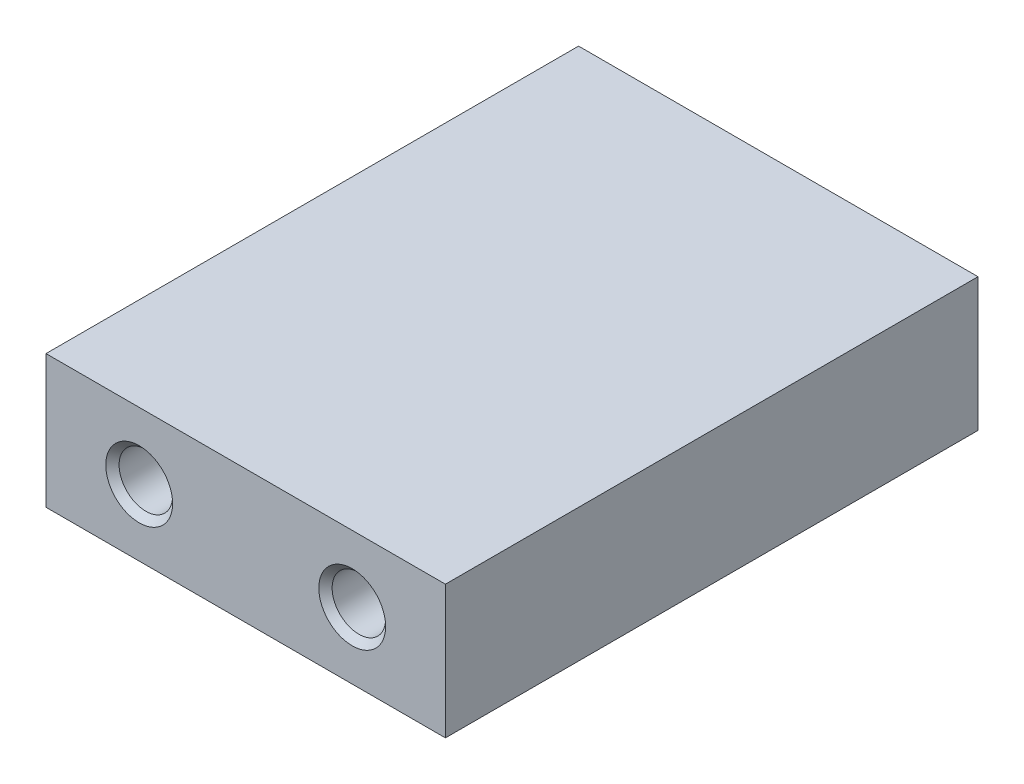
ISO-10303-21;
HEADER;
FILE_DESCRIPTION(('STEP AP214'),'2;1');
FILE_NAME('part.step','',(''),(''),'','','');
FILE_SCHEMA(('AUTOMOTIVE_DESIGN { 1 0 10303 214 1 1 1 1 }'));
ENDSEC;
DATA;
#1=APPLICATION_CONTEXT('core data for automotive mechanical design processes');
#2=APPLICATION_PROTOCOL_DEFINITION('international standard','automotive_design',2000,#1);
#3=PRODUCT_CONTEXT('',#1,'mechanical');
#4=PRODUCT('Part','Part','',(#3));
#5=PRODUCT_RELATED_PRODUCT_CATEGORY('part','',(#4));
#6=PRODUCT_DEFINITION_FORMATION('','',#4);
#7=PRODUCT_DEFINITION_CONTEXT('part definition',#1,'design');
#8=PRODUCT_DEFINITION('design','',#6,#7);
#9=PRODUCT_DEFINITION_SHAPE('','',#8);
#10=(LENGTH_UNIT() NAMED_UNIT(*) SI_UNIT(.MILLI.,.METRE.));
#11=(NAMED_UNIT(*) PLANE_ANGLE_UNIT() SI_UNIT($,.RADIAN.));
#12=(NAMED_UNIT(*) SI_UNIT($,.STERADIAN.) SOLID_ANGLE_UNIT());
#13=UNCERTAINTY_MEASURE_WITH_UNIT(LENGTH_MEASURE(1.E-05),#10,'distance_accuracy_value','');
#14=(GEOMETRIC_REPRESENTATION_CONTEXT(3) GLOBAL_UNCERTAINTY_ASSIGNED_CONTEXT((#13)) GLOBAL_UNIT_ASSIGNED_CONTEXT((#10,
#11,#12)) REPRESENTATION_CONTEXT('',''));
#15=CARTESIAN_POINT('',(0.,0.,0.));
#16=DIRECTION('',(0.,0.,1.));
#17=DIRECTION('',(1.,0.,0.));
#18=AXIS2_PLACEMENT_3D('',#15,#16,#17);
#19=CARTESIAN_POINT('',(19.05,-6.34999999999999,-50.8));
#20=DIRECTION('',(1.,0.,0.));
#21=DIRECTION('',(0.,0.,-1.));
#22=AXIS2_PLACEMENT_3D('',#19,#20,#21);
#23=PLANE('',#22);
#24=DIRECTION('',(0.,1.,0.));
#25=VECTOR('',#24,1.);
#26=CARTESIAN_POINT('',(19.05,-6.34999999999999,0.));
#27=LINE('',#26,#25);
#28=CARTESIAN_POINT('',(19.05,-6.34999999999999,0.));
#29=VERTEX_POINT('',#28);
#30=CARTESIAN_POINT('',(19.05,6.35,0.));
#31=VERTEX_POINT('',#30);
#32=EDGE_CURVE('E161',#29,#31,#27,.T.);
#33=ORIENTED_EDGE('',*,*,#32,.F.);
#34=DIRECTION('',(0.,0.,1.));
#35=VECTOR('',#34,1.);
#36=CARTESIAN_POINT('',(19.05,-6.34999999999999,-50.8));
#37=LINE('',#36,#35);
#38=CARTESIAN_POINT('',(19.05,-6.34999999999999,-50.8));
#39=VERTEX_POINT('',#38);
#40=EDGE_CURVE('E11',#39,#29,#37,.T.);
#41=ORIENTED_EDGE('',*,*,#40,.F.);
#42=DIRECTION('',(0.,1.,0.));
#43=VECTOR('',#42,1.);
#44=CARTESIAN_POINT('',(19.05,-6.34999999999999,-50.8));
#45=LINE('',#44,#43);
#46=CARTESIAN_POINT('',(19.05,6.35,-50.8));
#47=VERTEX_POINT('',#46);
#48=EDGE_CURVE('E162',#39,#47,#45,.T.);
#49=ORIENTED_EDGE('',*,*,#48,.T.);
#50=DIRECTION('',(0.,0.,1.));
#51=VECTOR('',#50,1.);
#52=CARTESIAN_POINT('',(19.05,6.35,-50.8));
#53=LINE('',#52,#51);
#54=EDGE_CURVE('E43',#47,#31,#53,.T.);
#55=ORIENTED_EDGE('',*,*,#54,.T.);
#56=EDGE_LOOP('',(#33,#41,#49,#55));
#57=FACE_BOUND('',#56,.T.);
#58=ADVANCED_FACE('F40',(#57),#23,.T.);
#59=CARTESIAN_POINT('',(-19.05,-6.34999999999999,-50.8));
#60=DIRECTION('',(0.,-1.,0.));
#61=DIRECTION('',(0.,0.,-1.));
#62=AXIS2_PLACEMENT_3D('',#59,#60,#61);
#63=PLANE('',#62);
#64=DIRECTION('',(1.,0.,0.));
#65=VECTOR('',#64,1.);
#66=CARTESIAN_POINT('',(-19.05,-6.34999999999999,0.));
#67=LINE('',#66,#65);
#68=CARTESIAN_POINT('',(-19.05,-6.34999999999999,0.));
#69=VERTEX_POINT('',#68);
#70=EDGE_CURVE('E165',#69,#29,#67,.T.);
#71=ORIENTED_EDGE('',*,*,#70,.F.);
#72=DIRECTION('',(0.,0.,1.));
#73=VECTOR('',#72,1.);
#74=CARTESIAN_POINT('',(-19.05,-6.34999999999999,-50.8));
#75=LINE('',#74,#73);
#76=CARTESIAN_POINT('',(-19.05,-6.34999999999999,-50.8));
#77=VERTEX_POINT('',#76);
#78=EDGE_CURVE('E49',#77,#69,#75,.T.);
#79=ORIENTED_EDGE('',*,*,#78,.F.);
#80=DIRECTION('',(1.,0.,0.));
#81=VECTOR('',#80,1.);
#82=CARTESIAN_POINT('',(-19.05,-6.34999999999999,-50.8));
#83=LINE('',#82,#81);
#84=EDGE_CURVE('E169',#77,#39,#83,.T.);
#85=ORIENTED_EDGE('',*,*,#84,.T.);
#86=ORIENTED_EDGE('',*,*,#40,.T.);
#87=EDGE_LOOP('',(#71,#79,#85,#86));
#88=FACE_BOUND('',#87,.T.);
#89=ADVANCED_FACE('F184',(#88),#63,.T.);
#90=CARTESIAN_POINT('',(-19.05,-6.34999999999999,-50.8));
#91=DIRECTION('',(-1.,0.,0.));
#92=DIRECTION('',(0.,0.,1.));
#93=AXIS2_PLACEMENT_3D('',#90,#91,#92);
#94=PLANE('',#93);
#95=CARTESIAN_POINT('',(-19.05,0.,-34.29));
#96=DIRECTION('',(-1.,0.,0.));
#97=DIRECTION('',(0.,0.,1.));
#98=AXIS2_PLACEMENT_3D('',#95,#96,#97);
#99=CIRCLE('',#98,1.5875);
#100=CARTESIAN_POINT('',(-19.05,0.,-32.7025));
#101=VERTEX_POINT('',#100);
#102=EDGE_CURVE('E115',#101,#101,#99,.T.);
#103=ORIENTED_EDGE('',*,*,#102,.F.);
#104=EDGE_LOOP('',(#103));
#105=FACE_BOUND('',#104,.T.);
#106=CARTESIAN_POINT('',(-19.05,0.,-16.51));
#107=DIRECTION('',(-1.,0.,0.));
#108=DIRECTION('',(0.,0.,1.));
#109=AXIS2_PLACEMENT_3D('',#106,#107,#108);
#110=CIRCLE('',#109,1.5875);
#111=CARTESIAN_POINT('',(-19.05,0.,-14.9225));
#112=VERTEX_POINT('',#111);
#113=EDGE_CURVE('E114',#112,#112,#110,.T.);
#114=ORIENTED_EDGE('',*,*,#113,.F.);
#115=EDGE_LOOP('',(#114));
#116=FACE_BOUND('',#115,.T.);
#117=DIRECTION('',(0.,-1.,0.));
#118=VECTOR('',#117,1.);
#119=CARTESIAN_POINT('',(-19.05,-6.34999999999999,0.));
#120=LINE('',#119,#118);
#121=CARTESIAN_POINT('',(-19.05,6.35,0.));
#122=VERTEX_POINT('',#121);
#123=EDGE_CURVE('E176',#122,#69,#120,.T.);
#124=ORIENTED_EDGE('',*,*,#123,.F.);
#125=DIRECTION('',(0.,0.,1.));
#126=VECTOR('',#125,1.);
#127=CARTESIAN_POINT('',(-19.05,6.35,-50.8));
#128=LINE('',#127,#126);
#129=CARTESIAN_POINT('',(-19.05,6.35,-50.8));
#130=VERTEX_POINT('',#129);
#131=EDGE_CURVE('E180',#130,#122,#128,.T.);
#132=ORIENTED_EDGE('',*,*,#131,.F.);
#133=DIRECTION('',(0.,-1.,0.));
#134=VECTOR('',#133,1.);
#135=CARTESIAN_POINT('',(-19.05,-6.34999999999999,-50.8));
#136=LINE('',#135,#134);
#137=EDGE_CURVE('E167',#130,#77,#136,.T.);
#138=ORIENTED_EDGE('',*,*,#137,.T.);
#139=ORIENTED_EDGE('',*,*,#78,.T.);
#140=EDGE_LOOP('',(#124,#132,#138,#139));
#141=FACE_BOUND('',#140,.T.);
#142=ADVANCED_FACE('F187',(#105,#116,#141),#94,.T.);
#143=CARTESIAN_POINT('',(-19.05,6.35,-50.8));
#144=DIRECTION('',(0.,1.,0.));
#145=DIRECTION('',(0.,0.,1.));
#146=AXIS2_PLACEMENT_3D('',#143,#144,#145);
#147=PLANE('',#146);
#148=DIRECTION('',(-1.,0.,0.));
#149=VECTOR('',#148,1.);
#150=CARTESIAN_POINT('',(-19.05,6.35,0.));
#151=LINE('',#150,#149);
#152=EDGE_CURVE('E173',#31,#122,#151,.T.);
#153=ORIENTED_EDGE('',*,*,#152,.F.);
#154=ORIENTED_EDGE('',*,*,#54,.F.);
#155=DIRECTION('',(-1.,0.,0.));
#156=VECTOR('',#155,1.);
#157=CARTESIAN_POINT('',(-19.05,6.35,-50.8));
#158=LINE('',#157,#156);
#159=EDGE_CURVE('E164',#47,#130,#158,.T.);
#160=ORIENTED_EDGE('',*,*,#159,.T.);
#161=ORIENTED_EDGE('',*,*,#131,.T.);
#162=EDGE_LOOP('',(#153,#154,#160,#161));
#163=FACE_BOUND('',#162,.T.);
#164=ADVANCED_FACE('F181',(#163),#147,.T.);
#165=CARTESIAN_POINT('',(0.,0.,-50.8));
#166=DIRECTION('',(0.,0.,-1.));
#167=DIRECTION('',(-1.,0.,0.));
#168=AXIS2_PLACEMENT_3D('',#165,#166,#167);
#169=PLANE('',#168);
#170=CARTESIAN_POINT('',(-10.1599999999965,0.,-50.8));
#171=DIRECTION('',(0.,0.,-1.));
#172=DIRECTION('',(-1.,0.,0.));
#173=AXIS2_PLACEMENT_3D('',#170,#171,#172);
#174=CIRCLE('',#173,3.1877);
#175=CARTESIAN_POINT('',(-13.3476999999965,0.,-50.8));
#176=VERTEX_POINT('',#175);
#177=EDGE_CURVE('E125',#176,#176,#174,.T.);
#178=ORIENTED_EDGE('',*,*,#177,.F.);
#179=EDGE_LOOP('',(#178));
#180=FACE_BOUND('',#179,.T.);
#181=CARTESIAN_POINT('',(10.1600000000035,0.,-50.8));
#182=DIRECTION('',(0.,0.,-1.));
#183=DIRECTION('',(-1.,0.,0.));
#184=AXIS2_PLACEMENT_3D('',#181,#182,#183);
#185=CIRCLE('',#184,3.1877);
#186=CARTESIAN_POINT('',(6.97230000000349,0.,-50.8));
#187=VERTEX_POINT('',#186);
#188=EDGE_CURVE('E134',#187,#187,#185,.T.);
#189=ORIENTED_EDGE('',*,*,#188,.F.);
#190=EDGE_LOOP('',(#189));
#191=FACE_BOUND('',#190,.T.);
#192=ORIENTED_EDGE('',*,*,#48,.F.);
#193=ORIENTED_EDGE('',*,*,#84,.F.);
#194=ORIENTED_EDGE('',*,*,#137,.F.);
#195=ORIENTED_EDGE('',*,*,#159,.F.);
#196=EDGE_LOOP('',(#192,#193,#194,#195));
#197=FACE_BOUND('',#196,.T.);
#198=ADVANCED_FACE('F189',(#180,#191,#197),#169,.T.);
#199=CARTESIAN_POINT('',(0.,0.,0.));
#200=DIRECTION('',(0.,0.,-1.));
#201=DIRECTION('',(-1.,0.,0.));
#202=AXIS2_PLACEMENT_3D('',#199,#200,#201);
#203=PLANE('',#202);
#204=CARTESIAN_POINT('',(-10.1599999999965,0.,0.));
#205=DIRECTION('',(0.,0.,1.));
#206=DIRECTION('',(1.,0.,0.));
#207=AXIS2_PLACEMENT_3D('',#204,#205,#206);
#208=CIRCLE('',#207,3.1877);
#209=CARTESIAN_POINT('',(-6.97229999999651,0.,0.));
#210=VERTEX_POINT('',#209);
#211=EDGE_CURVE('E143',#210,#210,#208,.T.);
#212=ORIENTED_EDGE('',*,*,#211,.F.);
#213=EDGE_LOOP('',(#212));
#214=FACE_BOUND('',#213,.T.);
#215=CARTESIAN_POINT('',(10.1600000000035,0.,0.));
#216=DIRECTION('',(0.,0.,1.));
#217=DIRECTION('',(1.,0.,0.));
#218=AXIS2_PLACEMENT_3D('',#215,#216,#217);
#219=CIRCLE('',#218,3.1877);
#220=CARTESIAN_POINT('',(13.3477000000035,0.,0.));
#221=VERTEX_POINT('',#220);
#222=EDGE_CURVE('E152',#221,#221,#219,.T.);
#223=ORIENTED_EDGE('',*,*,#222,.F.);
#224=EDGE_LOOP('',(#223));
#225=FACE_BOUND('',#224,.T.);
#226=ORIENTED_EDGE('',*,*,#32,.T.);
#227=ORIENTED_EDGE('',*,*,#152,.T.);
#228=ORIENTED_EDGE('',*,*,#123,.T.);
#229=ORIENTED_EDGE('',*,*,#70,.T.);
#230=EDGE_LOOP('',(#226,#227,#228,#229));
#231=FACE_BOUND('',#230,.T.);
#232=ADVANCED_FACE('F183',(#214,#225,#231),#203,.F.);
#233=CARTESIAN_POINT('',(10.1600000000035,0.,-12.7));
#234=DIRECTION('',(0.,0.,1.));
#235=DIRECTION('',(1.,0.,0.));
#236=AXIS2_PLACEMENT_3D('',#233,#234,#235);
#237=CONICAL_SURFACE('',#236,2.5527,1.02974425867665);
#238=CARTESIAN_POINT('',(10.1600000000035,0.,-14.2338169021917));
#239=VERTEX_POINT('',#238);
#240=VERTEX_LOOP('',#239);
#241=FACE_BOUND('',#240,.T.);
#242=CARTESIAN_POINT('',(10.1600000000035,0.,-12.7));
#243=DIRECTION('',(0.,0.,1.));
#244=DIRECTION('',(1.,0.,0.));
#245=AXIS2_PLACEMENT_3D('',#242,#243,#244);
#246=CIRCLE('',#245,2.5527);
#247=CARTESIAN_POINT('',(12.7127000000035,0.,-12.7));
#248=VERTEX_POINT('',#247);
#249=EDGE_CURVE('E158',#248,#248,#246,.T.);
#250=ORIENTED_EDGE('',*,*,#249,.T.);
#251=EDGE_LOOP('',(#250));
#252=FACE_BOUND('',#251,.T.);
#253=ADVANCED_FACE('F197',(#241,#252),#237,.F.);
#254=CARTESIAN_POINT('',(10.1600000000035,0.,0.));
#255=DIRECTION('',(0.,0.,1.));
#256=DIRECTION('',(1.,0.,0.));
#257=AXIS2_PLACEMENT_3D('',#254,#255,#256);
#258=CYLINDRICAL_SURFACE('',#257,2.5527);
#259=ORIENTED_EDGE('',*,*,#249,.F.);
#260=EDGE_LOOP('',(#259));
#261=FACE_BOUND('',#260,.T.);
#262=CARTESIAN_POINT('',(10.1600000000035,0.,-0.634999999999997));
#263=DIRECTION('',(0.,0.,1.));
#264=DIRECTION('',(1.,0.,0.));
#265=AXIS2_PLACEMENT_3D('',#262,#263,#264);
#266=CIRCLE('',#265,2.5527);
#267=CARTESIAN_POINT('',(12.7127000000035,0.,-0.634999999999997));
#268=VERTEX_POINT('',#267);
#269=EDGE_CURVE('E155',#268,#268,#266,.T.);
#270=ORIENTED_EDGE('',*,*,#269,.T.);
#271=EDGE_LOOP('',(#270));
#272=FACE_BOUND('',#271,.T.);
#273=ADVANCED_FACE('F270',(#261,#272),#258,.F.);
#274=CARTESIAN_POINT('',(10.1600000000035,0.,0.));
#275=DIRECTION('',(0.,0.,1.));
#276=DIRECTION('',(1.,0.,0.));
#277=AXIS2_PLACEMENT_3D('',#274,#275,#276);
#278=CONICAL_SURFACE('',#277,3.1877,0.785398163397446);
#279=ORIENTED_EDGE('',*,*,#269,.F.);
#280=EDGE_LOOP('',(#279));
#281=FACE_BOUND('',#280,.T.);
#282=ORIENTED_EDGE('',*,*,#222,.T.);
#283=EDGE_LOOP('',(#282));
#284=FACE_BOUND('',#283,.T.);
#285=ADVANCED_FACE('F266',(#281,#284),#278,.F.);
#286=CARTESIAN_POINT('',(-10.1599999999965,0.,-12.7));
#287=DIRECTION('',(0.,0.,1.));
#288=DIRECTION('',(1.,0.,0.));
#289=AXIS2_PLACEMENT_3D('',#286,#287,#288);
#290=CONICAL_SURFACE('',#289,2.5527,1.02974425867665);
#291=CARTESIAN_POINT('',(-10.1599999999965,0.,-14.2338169021917));
#292=VERTEX_POINT('',#291);
#293=VERTEX_LOOP('',#292);
#294=FACE_BOUND('',#293,.T.);
#295=CARTESIAN_POINT('',(-10.1599999999965,0.,-12.7));
#296=DIRECTION('',(0.,0.,1.));
#297=DIRECTION('',(1.,0.,0.));
#298=AXIS2_PLACEMENT_3D('',#295,#296,#297);
#299=CIRCLE('',#298,2.5527);
#300=CARTESIAN_POINT('',(-7.60729999999651,0.,-12.7));
#301=VERTEX_POINT('',#300);
#302=EDGE_CURVE('E149',#301,#301,#299,.T.);
#303=ORIENTED_EDGE('',*,*,#302,.T.);
#304=EDGE_LOOP('',(#303));
#305=FACE_BOUND('',#304,.T.);
#306=ADVANCED_FACE('F262',(#294,#305),#290,.F.);
#307=CARTESIAN_POINT('',(-10.1599999999965,0.,0.));
#308=DIRECTION('',(0.,0.,1.));
#309=DIRECTION('',(1.,0.,0.));
#310=AXIS2_PLACEMENT_3D('',#307,#308,#309);
#311=CYLINDRICAL_SURFACE('',#310,2.5527);
#312=ORIENTED_EDGE('',*,*,#302,.F.);
#313=EDGE_LOOP('',(#312));
#314=FACE_BOUND('',#313,.T.);
#315=CARTESIAN_POINT('',(-10.1599999999965,0.,-0.634999999999997));
#316=DIRECTION('',(0.,0.,1.));
#317=DIRECTION('',(1.,0.,0.));
#318=AXIS2_PLACEMENT_3D('',#315,#316,#317);
#319=CIRCLE('',#318,2.5527);
#320=CARTESIAN_POINT('',(-7.60729999999651,0.,-0.634999999999997));
#321=VERTEX_POINT('',#320);
#322=EDGE_CURVE('E146',#321,#321,#319,.T.);
#323=ORIENTED_EDGE('',*,*,#322,.T.);
#324=EDGE_LOOP('',(#323));
#325=FACE_BOUND('',#324,.T.);
#326=ADVANCED_FACE('F258',(#314,#325),#311,.F.);
#327=CARTESIAN_POINT('',(-10.1599999999965,0.,0.));
#328=DIRECTION('',(0.,0.,1.));
#329=DIRECTION('',(1.,0.,0.));
#330=AXIS2_PLACEMENT_3D('',#327,#328,#329);
#331=CONICAL_SURFACE('',#330,3.1877,0.785398163397446);
#332=ORIENTED_EDGE('',*,*,#322,.F.);
#333=EDGE_LOOP('',(#332));
#334=FACE_BOUND('',#333,.T.);
#335=ORIENTED_EDGE('',*,*,#211,.T.);
#336=EDGE_LOOP('',(#335));
#337=FACE_BOUND('',#336,.T.);
#338=ADVANCED_FACE('F254',(#334,#337),#331,.F.);
#339=CARTESIAN_POINT('',(10.1600000000035,0.,-38.1));
#340=DIRECTION('',(0.,0.,-1.));
#341=DIRECTION('',(-1.,0.,0.));
#342=AXIS2_PLACEMENT_3D('',#339,#340,#341);
#343=CONICAL_SURFACE('',#342,2.5527,1.02974425867665);
#344=CARTESIAN_POINT('',(10.1600000000035,0.,-36.5661830978083));
#345=VERTEX_POINT('',#344);
#346=VERTEX_LOOP('',#345);
#347=FACE_BOUND('',#346,.T.);
#348=CARTESIAN_POINT('',(10.1600000000035,0.,-38.1));
#349=DIRECTION('',(0.,0.,-1.));
#350=DIRECTION('',(-1.,0.,0.));
#351=AXIS2_PLACEMENT_3D('',#348,#349,#350);
#352=CIRCLE('',#351,2.5527);
#353=CARTESIAN_POINT('',(7.60730000000349,0.,-38.1));
#354=VERTEX_POINT('',#353);
#355=EDGE_CURVE('E140',#354,#354,#352,.T.);
#356=ORIENTED_EDGE('',*,*,#355,.T.);
#357=EDGE_LOOP('',(#356));
#358=FACE_BOUND('',#357,.T.);
#359=ADVANCED_FACE('F250',(#347,#358),#343,.F.);
#360=CARTESIAN_POINT('',(10.1600000000035,0.,-50.8));
#361=DIRECTION('',(0.,0.,-1.));
#362=DIRECTION('',(-1.,0.,0.));
#363=AXIS2_PLACEMENT_3D('',#360,#361,#362);
#364=CYLINDRICAL_SURFACE('',#363,2.5527);
#365=ORIENTED_EDGE('',*,*,#355,.F.);
#366=EDGE_LOOP('',(#365));
#367=FACE_BOUND('',#366,.T.);
#368=CARTESIAN_POINT('',(10.1600000000035,0.,-50.165));
#369=DIRECTION('',(0.,0.,-1.));
#370=DIRECTION('',(-1.,0.,0.));
#371=AXIS2_PLACEMENT_3D('',#368,#369,#370);
#372=CIRCLE('',#371,2.5527);
#373=CARTESIAN_POINT('',(7.60730000000349,0.,-50.165));
#374=VERTEX_POINT('',#373);
#375=EDGE_CURVE('E137',#374,#374,#372,.T.);
#376=ORIENTED_EDGE('',*,*,#375,.T.);
#377=EDGE_LOOP('',(#376));
#378=FACE_BOUND('',#377,.T.);
#379=ADVANCED_FACE('F246',(#367,#378),#364,.F.);
#380=CARTESIAN_POINT('',(10.1600000000035,0.,-50.8));
#381=DIRECTION('',(0.,0.,-1.));
#382=DIRECTION('',(-1.,0.,0.));
#383=AXIS2_PLACEMENT_3D('',#380,#381,#382);
#384=CONICAL_SURFACE('',#383,3.1877,0.785398163397447);
#385=ORIENTED_EDGE('',*,*,#375,.F.);
#386=EDGE_LOOP('',(#385));
#387=FACE_BOUND('',#386,.T.);
#388=ORIENTED_EDGE('',*,*,#188,.T.);
#389=EDGE_LOOP('',(#388));
#390=FACE_BOUND('',#389,.T.);
#391=ADVANCED_FACE('F242',(#387,#390),#384,.F.);
#392=CARTESIAN_POINT('',(-10.1599999999965,0.,-38.1));
#393=DIRECTION('',(0.,0.,-1.));
#394=DIRECTION('',(-1.,0.,0.));
#395=AXIS2_PLACEMENT_3D('',#392,#393,#394);
#396=CONICAL_SURFACE('',#395,2.5527,1.02974425867665);
#397=CARTESIAN_POINT('',(-10.1599999999965,0.,-36.5661830978083));
#398=VERTEX_POINT('',#397);
#399=VERTEX_LOOP('',#398);
#400=FACE_BOUND('',#399,.T.);
#401=CARTESIAN_POINT('',(-10.1599999999965,0.,-38.1));
#402=DIRECTION('',(0.,0.,-1.));
#403=DIRECTION('',(-1.,0.,0.));
#404=AXIS2_PLACEMENT_3D('',#401,#402,#403);
#405=CIRCLE('',#404,2.5527);
#406=CARTESIAN_POINT('',(-12.7126999999965,0.,-38.1));
#407=VERTEX_POINT('',#406);
#408=EDGE_CURVE('E131',#407,#407,#405,.T.);
#409=ORIENTED_EDGE('',*,*,#408,.T.);
#410=EDGE_LOOP('',(#409));
#411=FACE_BOUND('',#410,.T.);
#412=ADVANCED_FACE('F238',(#400,#411),#396,.F.);
#413=CARTESIAN_POINT('',(-10.1599999999965,0.,-50.8));
#414=DIRECTION('',(0.,0.,-1.));
#415=DIRECTION('',(-1.,0.,0.));
#416=AXIS2_PLACEMENT_3D('',#413,#414,#415);
#417=CYLINDRICAL_SURFACE('',#416,2.5527);
#418=ORIENTED_EDGE('',*,*,#408,.F.);
#419=EDGE_LOOP('',(#418));
#420=FACE_BOUND('',#419,.T.);
#421=CARTESIAN_POINT('',(-10.1599999999965,0.,-50.165));
#422=DIRECTION('',(0.,0.,-1.));
#423=DIRECTION('',(-1.,0.,0.));
#424=AXIS2_PLACEMENT_3D('',#421,#422,#423);
#425=CIRCLE('',#424,2.5527);
#426=CARTESIAN_POINT('',(-12.7126999999965,0.,-50.165));
#427=VERTEX_POINT('',#426);
#428=EDGE_CURVE('E128',#427,#427,#425,.T.);
#429=ORIENTED_EDGE('',*,*,#428,.T.);
#430=EDGE_LOOP('',(#429));
#431=FACE_BOUND('',#430,.T.);
#432=ADVANCED_FACE('F234',(#420,#431),#417,.F.);
#433=CARTESIAN_POINT('',(-10.1599999999965,0.,-50.8));
#434=DIRECTION('',(0.,0.,-1.));
#435=DIRECTION('',(-1.,0.,0.));
#436=AXIS2_PLACEMENT_3D('',#433,#434,#435);
#437=CONICAL_SURFACE('',#436,3.1877,0.785398163397447);
#438=ORIENTED_EDGE('',*,*,#428,.F.);
#439=EDGE_LOOP('',(#438));
#440=FACE_BOUND('',#439,.T.);
#441=ORIENTED_EDGE('',*,*,#177,.T.);
#442=EDGE_LOOP('',(#441));
#443=FACE_BOUND('',#442,.T.);
#444=ADVANCED_FACE('F226',(#440,#443),#437,.F.);
#445=CARTESIAN_POINT('',(-13.97,0.,-16.51));
#446=DIRECTION('',(-1.,0.,0.));
#447=DIRECTION('',(0.,0.,1.));
#448=AXIS2_PLACEMENT_3D('',#445,#446,#447);
#449=CONICAL_SURFACE('',#448,1.5875,1.02974425867665);
#450=CARTESIAN_POINT('',(-13.0161337672937,0.,-16.51));
#451=VERTEX_POINT('',#450);
#452=VERTEX_LOOP('',#451);
#453=FACE_BOUND('',#452,.T.);
#454=CARTESIAN_POINT('',(-13.97,0.,-16.51));
#455=DIRECTION('',(-1.,0.,0.));
#456=DIRECTION('',(0.,0.,1.));
#457=AXIS2_PLACEMENT_3D('',#454,#455,#456);
#458=CIRCLE('',#457,1.5875);
#459=CARTESIAN_POINT('',(-13.97,0.,-14.9225));
#460=VERTEX_POINT('',#459);
#461=EDGE_CURVE('E118',#460,#460,#458,.T.);
#462=ORIENTED_EDGE('',*,*,#461,.T.);
#463=EDGE_LOOP('',(#462));
#464=FACE_BOUND('',#463,.T.);
#465=ADVANCED_FACE('F220',(#453,#464),#449,.F.);
#466=CARTESIAN_POINT('',(-19.05,0.,-16.51));
#467=DIRECTION('',(-1.,0.,0.));
#468=DIRECTION('',(0.,0.,1.));
#469=AXIS2_PLACEMENT_3D('',#466,#467,#468);
#470=CYLINDRICAL_SURFACE('',#469,1.5875);
#471=ORIENTED_EDGE('',*,*,#461,.F.);
#472=EDGE_LOOP('',(#471));
#473=FACE_BOUND('',#472,.T.);
#474=ORIENTED_EDGE('',*,*,#113,.T.);
#475=EDGE_LOOP('',(#474));
#476=FACE_BOUND('',#475,.T.);
#477=ADVANCED_FACE('F108',(#473,#476),#470,.F.);
#478=CARTESIAN_POINT('',(-13.97,0.,-34.29));
#479=DIRECTION('',(-1.,0.,0.));
#480=DIRECTION('',(0.,0.,1.));
#481=AXIS2_PLACEMENT_3D('',#478,#479,#480);
#482=CONICAL_SURFACE('',#481,1.5875,1.02974425867665);
#483=CARTESIAN_POINT('',(-13.0161337672937,0.,-34.29));
#484=VERTEX_POINT('',#483);
#485=VERTEX_LOOP('',#484);
#486=FACE_BOUND('',#485,.T.);
#487=CARTESIAN_POINT('',(-13.97,0.,-34.29));
#488=DIRECTION('',(-1.,0.,0.));
#489=DIRECTION('',(0.,0.,1.));
#490=AXIS2_PLACEMENT_3D('',#487,#488,#489);
#491=CIRCLE('',#490,1.5875);
#492=CARTESIAN_POINT('',(-13.97,0.,-32.7025));
#493=VERTEX_POINT('',#492);
#494=EDGE_CURVE('E112',#493,#493,#491,.T.);
#495=ORIENTED_EDGE('',*,*,#494,.T.);
#496=EDGE_LOOP('',(#495));
#497=FACE_BOUND('',#496,.T.);
#498=ADVANCED_FACE('F104',(#486,#497),#482,.F.);
#499=CARTESIAN_POINT('',(-19.05,0.,-34.29));
#500=DIRECTION('',(-1.,0.,0.));
#501=DIRECTION('',(0.,0.,1.));
#502=AXIS2_PLACEMENT_3D('',#499,#500,#501);
#503=CYLINDRICAL_SURFACE('',#502,1.5875);
#504=ORIENTED_EDGE('',*,*,#494,.F.);
#505=EDGE_LOOP('',(#504));
#506=FACE_BOUND('',#505,.T.);
#507=ORIENTED_EDGE('',*,*,#102,.T.);
#508=EDGE_LOOP('',(#507));
#509=FACE_BOUND('',#508,.T.);
#510=ADVANCED_FACE('F107',(#506,#509),#503,.F.);
#511=CLOSED_SHELL('',(#58,#89,#142,#164,#198,#232,#253,#273,#285,#306,#326,#338,#359,#379,#391,
#412,#432,#444,#465,#477,#498,#510));
#512=MANIFOLD_SOLID_BREP('B2',#511);
#513=ADVANCED_BREP_SHAPE_REPRESENTATION('',(#18,#512),#14);
#514=SHAPE_DEFINITION_REPRESENTATION(#9,#513);
ENDSEC;
END-ISO-10303-21;
